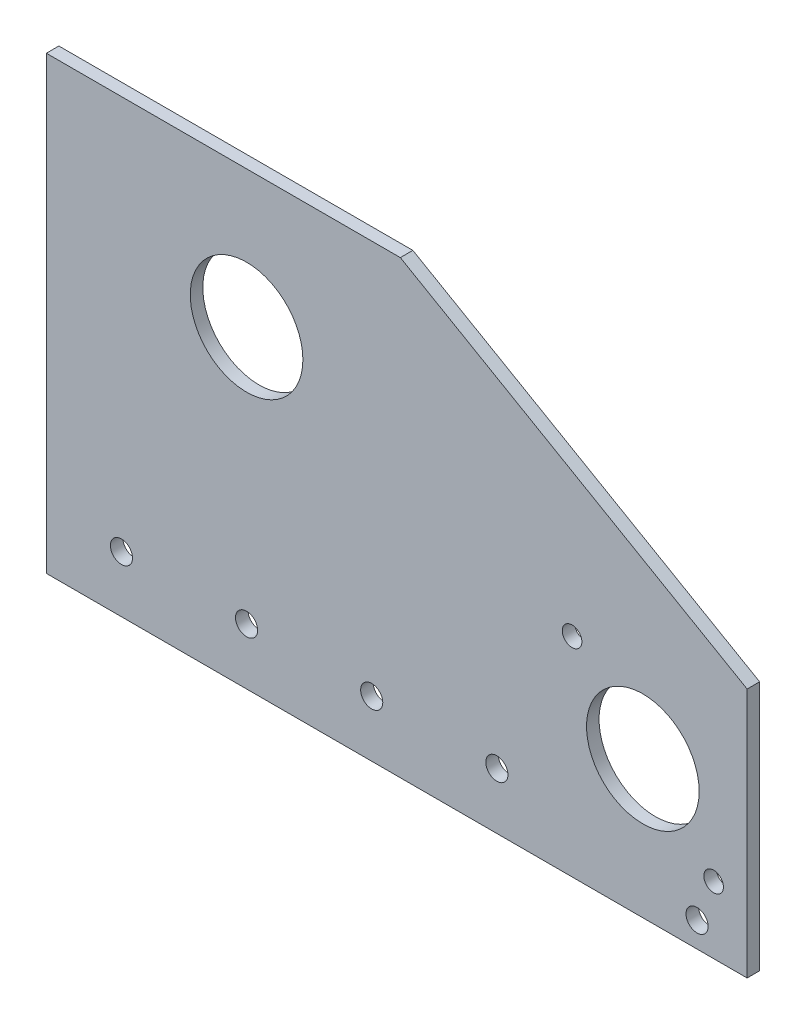
ISO-10303-21;
HEADER;
FILE_DESCRIPTION(('STEP AP214'),'2;1');
FILE_NAME('part.step','',(''),(''),'','','');
FILE_SCHEMA(('AUTOMOTIVE_DESIGN { 1 0 10303 214 1 1 1 1 }'));
ENDSEC;
DATA;
#1=APPLICATION_CONTEXT('core data for automotive mechanical design processes');
#2=APPLICATION_PROTOCOL_DEFINITION('international standard','automotive_design',2000,#1);
#3=PRODUCT_CONTEXT('',#1,'mechanical');
#4=PRODUCT('Part','Part','',(#3));
#5=PRODUCT_RELATED_PRODUCT_CATEGORY('part','',(#4));
#6=PRODUCT_DEFINITION_FORMATION('','',#4);
#7=PRODUCT_DEFINITION_CONTEXT('part definition',#1,'design');
#8=PRODUCT_DEFINITION('design','',#6,#7);
#9=PRODUCT_DEFINITION_SHAPE('','',#8);
#10=(LENGTH_UNIT() NAMED_UNIT(*) SI_UNIT(.MILLI.,.METRE.));
#11=(NAMED_UNIT(*) PLANE_ANGLE_UNIT() SI_UNIT($,.RADIAN.));
#12=(NAMED_UNIT(*) SI_UNIT($,.STERADIAN.) SOLID_ANGLE_UNIT());
#13=UNCERTAINTY_MEASURE_WITH_UNIT(LENGTH_MEASURE(1.E-05),#10,'distance_accuracy_value','');
#14=(GEOMETRIC_REPRESENTATION_CONTEXT(3) GLOBAL_UNCERTAINTY_ASSIGNED_CONTEXT((#13)) GLOBAL_UNIT_ASSIGNED_CONTEXT((#10,
#11,#12)) REPRESENTATION_CONTEXT('',''));
#15=CARTESIAN_POINT('',(0.,0.,0.));
#16=DIRECTION('',(0.,0.,1.));
#17=DIRECTION('',(1.,0.,0.));
#18=AXIS2_PLACEMENT_3D('',#15,#16,#17);
#19=CARTESIAN_POINT('',(88.9,57.15,3.175));
#20=DIRECTION('',(-1.,0.,0.));
#21=DIRECTION('',(0.,-1.,0.));
#22=AXIS2_PLACEMENT_3D('',#19,#20,#21);
#23=PLANE('',#22);
#24=DIRECTION('',(0.,1.,0.));
#25=VECTOR('',#24,1.);
#26=CARTESIAN_POINT('',(88.9,57.15,0.));
#27=LINE('',#26,#25);
#28=CARTESIAN_POINT('',(88.9,-57.15,0.));
#29=VERTEX_POINT('',#28);
#30=CARTESIAN_POINT('',(88.9,6.34999999999987,0.));
#31=VERTEX_POINT('',#30);
#32=EDGE_CURVE('E110',#29,#31,#27,.T.);
#33=ORIENTED_EDGE('',*,*,#32,.T.);
#34=DIRECTION('',(0.,0.,1.));
#35=VECTOR('',#34,1.);
#36=CARTESIAN_POINT('',(88.9,6.34999999999987,3.175));
#37=LINE('',#36,#35);
#38=CARTESIAN_POINT('',(88.9,6.34999999999987,3.175));
#39=VERTEX_POINT('',#38);
#40=EDGE_CURVE('E42',#31,#39,#37,.T.);
#41=ORIENTED_EDGE('',*,*,#40,.T.);
#42=DIRECTION('',(0.,1.,0.));
#43=VECTOR('',#42,1.);
#44=CARTESIAN_POINT('',(88.9,57.15,3.175));
#45=LINE('',#44,#43);
#46=CARTESIAN_POINT('',(88.9,-57.15,3.175));
#47=VERTEX_POINT('',#46);
#48=EDGE_CURVE('E90',#47,#39,#45,.T.);
#49=ORIENTED_EDGE('',*,*,#48,.F.);
#50=DIRECTION('',(0.,0.,-1.));
#51=VECTOR('',#50,1.);
#52=CARTESIAN_POINT('',(88.9,-57.15,3.175));
#53=LINE('',#52,#51);
#54=EDGE_CURVE('E106',#47,#29,#53,.T.);
#55=ORIENTED_EDGE('',*,*,#54,.T.);
#56=EDGE_LOOP('',(#33,#41,#49,#55));
#57=FACE_BOUND('',#56,.T.);
#58=ADVANCED_FACE('F34',(#57),#23,.F.);
#59=CARTESIAN_POINT('',(-88.9,57.15,3.175));
#60=DIRECTION('',(0.,-1.,0.));
#61=DIRECTION('',(0.,0.,-1.));
#62=AXIS2_PLACEMENT_3D('',#59,#60,#61);
#63=PLANE('',#62);
#64=DIRECTION('',(-1.,0.,0.));
#65=VECTOR('',#64,1.);
#66=CARTESIAN_POINT('',(-88.9,57.15,3.175));
#67=LINE('',#66,#65);
#68=CARTESIAN_POINT('',(0.911818975500972,57.15,3.175));
#69=VERTEX_POINT('',#68);
#70=CARTESIAN_POINT('',(-88.9,57.15,3.175));
#71=VERTEX_POINT('',#70);
#72=EDGE_CURVE('E80',#69,#71,#67,.T.);
#73=ORIENTED_EDGE('',*,*,#72,.F.);
#74=DIRECTION('',(0.,0.,-1.));
#75=VECTOR('',#74,1.);
#76=CARTESIAN_POINT('',(0.911818975501036,57.15,3.175));
#77=LINE('',#76,#75);
#78=CARTESIAN_POINT('',(0.911818975500975,57.15,0.));
#79=VERTEX_POINT('',#78);
#80=EDGE_CURVE('E98',#69,#79,#77,.T.);
#81=ORIENTED_EDGE('',*,*,#80,.T.);
#82=DIRECTION('',(-1.,0.,0.));
#83=VECTOR('',#82,1.);
#84=CARTESIAN_POINT('',(-88.9,57.15,0.));
#85=LINE('',#84,#83);
#86=CARTESIAN_POINT('',(-88.9,57.15,0.));
#87=VERTEX_POINT('',#86);
#88=EDGE_CURVE('E95',#79,#87,#85,.T.);
#89=ORIENTED_EDGE('',*,*,#88,.T.);
#90=DIRECTION('',(0.,0.,-1.));
#91=VECTOR('',#90,1.);
#92=CARTESIAN_POINT('',(-88.9,57.15,3.175));
#93=LINE('',#92,#91);
#94=EDGE_CURVE('E93',#71,#87,#93,.T.);
#95=ORIENTED_EDGE('',*,*,#94,.F.);
#96=EDGE_LOOP('',(#73,#81,#89,#95));
#97=FACE_BOUND('',#96,.T.);
#98=ADVANCED_FACE('F94',(#97),#63,.F.);
#99=CARTESIAN_POINT('',(-88.9,57.15,3.175));
#100=DIRECTION('',(1.,0.,0.));
#101=DIRECTION('',(0.,1.,0.));
#102=AXIS2_PLACEMENT_3D('',#99,#100,#101);
#103=PLANE('',#102);
#104=DIRECTION('',(0.,-1.,0.));
#105=VECTOR('',#104,1.);
#106=CARTESIAN_POINT('',(-88.9,57.15,0.));
#107=LINE('',#106,#105);
#108=CARTESIAN_POINT('',(-88.9,-57.15,0.));
#109=VERTEX_POINT('',#108);
#110=EDGE_CURVE('E114',#87,#109,#107,.T.);
#111=ORIENTED_EDGE('',*,*,#110,.T.);
#112=DIRECTION('',(0.,0.,-1.));
#113=VECTOR('',#112,1.);
#114=CARTESIAN_POINT('',(-88.9,-57.15,3.175));
#115=LINE('',#114,#113);
#116=CARTESIAN_POINT('',(-88.9,-57.15,3.175));
#117=VERTEX_POINT('',#116);
#118=EDGE_CURVE('E99',#117,#109,#115,.T.);
#119=ORIENTED_EDGE('',*,*,#118,.F.);
#120=DIRECTION('',(0.,-1.,0.));
#121=VECTOR('',#120,1.);
#122=CARTESIAN_POINT('',(-88.9,57.15,3.175));
#123=LINE('',#122,#121);
#124=EDGE_CURVE('E84',#71,#117,#123,.T.);
#125=ORIENTED_EDGE('',*,*,#124,.F.);
#126=ORIENTED_EDGE('',*,*,#94,.T.);
#127=EDGE_LOOP('',(#111,#119,#125,#126));
#128=FACE_BOUND('',#127,.T.);
#129=ADVANCED_FACE('F101',(#128),#103,.F.);
#130=CARTESIAN_POINT('',(-88.9,-57.15,3.175));
#131=DIRECTION('',(0.,1.,0.));
#132=DIRECTION('',(0.,0.,1.));
#133=AXIS2_PLACEMENT_3D('',#130,#131,#132);
#134=PLANE('',#133);
#135=DIRECTION('',(1.,0.,0.));
#136=VECTOR('',#135,1.);
#137=CARTESIAN_POINT('',(-88.9,-57.15,0.));
#138=LINE('',#137,#136);
#139=EDGE_CURVE('E116',#109,#29,#138,.T.);
#140=ORIENTED_EDGE('',*,*,#139,.T.);
#141=ORIENTED_EDGE('',*,*,#54,.F.);
#142=DIRECTION('',(1.,0.,0.));
#143=VECTOR('',#142,1.);
#144=CARTESIAN_POINT('',(-88.9,-57.15,3.175));
#145=LINE('',#144,#143);
#146=EDGE_CURVE('E104',#117,#47,#145,.T.);
#147=ORIENTED_EDGE('',*,*,#146,.F.);
#148=ORIENTED_EDGE('',*,*,#118,.T.);
#149=EDGE_LOOP('',(#140,#141,#147,#148));
#150=FACE_BOUND('',#149,.T.);
#151=ADVANCED_FACE('F126',(#150),#134,.F.);
#152=CARTESIAN_POINT('',(0.,0.,3.175));
#153=DIRECTION('',(0.,0.,1.));
#154=DIRECTION('',(1.,0.,0.));
#155=AXIS2_PLACEMENT_3D('',#152,#153,#154);
#156=PLANE('',#155);
#157=CARTESIAN_POINT('',(76.2,-50.8,3.175));
#158=DIRECTION('',(0.,0.,-1.));
#159=DIRECTION('',(-1.,0.,0.));
#160=AXIS2_PLACEMENT_3D('',#157,#158,#159);
#161=CIRCLE('',#160,2.8067);
#162=CARTESIAN_POINT('',(73.3933,-50.8,3.175));
#163=VERTEX_POINT('',#162);
#164=EDGE_CURVE('E265',#163,#163,#161,.T.);
#165=ORIENTED_EDGE('',*,*,#164,.T.);
#166=EDGE_LOOP('',(#165));
#167=FACE_BOUND('',#166,.T.);
#168=CARTESIAN_POINT('',(80.4036939851088,-40.1855122421383,3.175));
#169=DIRECTION('',(0.,0.,1.));
#170=DIRECTION('',(1.,0.,0.));
#171=AXIS2_PLACEMENT_3D('',#168,#169,#170);
#172=CIRCLE('',#171,2.4892);
#173=CARTESIAN_POINT('',(82.8928939851088,-40.1855122421383,3.175));
#174=VERTEX_POINT('',#173);
#175=EDGE_CURVE('E197',#174,#174,#172,.T.);
#176=ORIENTED_EDGE('',*,*,#175,.F.);
#177=EDGE_LOOP('',(#176));
#178=FACE_BOUND('',#177,.T.);
#179=CARTESIAN_POINT('',(44.4826695008322,-4.26448775786168,3.175));
#180=DIRECTION('',(0.,0.,1.));
#181=DIRECTION('',(1.,0.,0.));
#182=AXIS2_PLACEMENT_3D('',#179,#180,#181);
#183=CIRCLE('',#182,2.4892);
#184=CARTESIAN_POINT('',(46.9718695008322,-4.26448775786168,3.175));
#185=VERTEX_POINT('',#184);
#186=EDGE_CURVE('E190',#185,#185,#183,.T.);
#187=ORIENTED_EDGE('',*,*,#186,.F.);
#188=EDGE_LOOP('',(#187));
#189=FACE_BOUND('',#188,.T.);
#190=CARTESIAN_POINT('',(62.4431817429705,-22.225,3.175));
#191=DIRECTION('',(0.,0.,1.));
#192=DIRECTION('',(1.,0.,0.));
#193=AXIS2_PLACEMENT_3D('',#190,#191,#192);
#194=CIRCLE('',#193,14.2875);
#195=CARTESIAN_POINT('',(76.7306817429705,-22.225,3.175));
#196=VERTEX_POINT('',#195);
#197=EDGE_CURVE('E194',#196,#196,#194,.T.);
#198=ORIENTED_EDGE('',*,*,#197,.F.);
#199=EDGE_LOOP('',(#198));
#200=FACE_BOUND('',#199,.T.);
#201=CARTESIAN_POINT('',(-69.85,-42.8625,3.175));
#202=DIRECTION('',(0.,0.,1.));
#203=DIRECTION('',(1.,0.,0.));
#204=AXIS2_PLACEMENT_3D('',#201,#202,#203);
#205=CIRCLE('',#204,2.8067);
#206=CARTESIAN_POINT('',(-67.0433,-42.8625,3.175));
#207=VERTEX_POINT('',#206);
#208=EDGE_CURVE('E204',#207,#207,#205,.T.);
#209=ORIENTED_EDGE('',*,*,#208,.F.);
#210=EDGE_LOOP('',(#209));
#211=FACE_BOUND('',#210,.T.);
#212=CARTESIAN_POINT('',(-38.1,-42.8625,3.175));
#213=DIRECTION('',(0.,0.,1.));
#214=DIRECTION('',(1.,0.,0.));
#215=AXIS2_PLACEMENT_3D('',#212,#213,#214);
#216=CIRCLE('',#215,2.8067);
#217=CARTESIAN_POINT('',(-35.2933,-42.8625,3.175));
#218=VERTEX_POINT('',#217);
#219=EDGE_CURVE('E212',#218,#218,#216,.T.);
#220=ORIENTED_EDGE('',*,*,#219,.F.);
#221=EDGE_LOOP('',(#220));
#222=FACE_BOUND('',#221,.T.);
#223=CARTESIAN_POINT('',(-6.35000000000001,-42.8625,3.175));
#224=DIRECTION('',(0.,0.,1.));
#225=DIRECTION('',(1.,0.,0.));
#226=AXIS2_PLACEMENT_3D('',#223,#224,#225);
#227=CIRCLE('',#226,2.8067);
#228=CARTESIAN_POINT('',(-3.54330000000001,-42.8625,3.175));
#229=VERTEX_POINT('',#228);
#230=EDGE_CURVE('E218',#229,#229,#227,.T.);
#231=ORIENTED_EDGE('',*,*,#230,.F.);
#232=EDGE_LOOP('',(#231));
#233=FACE_BOUND('',#232,.T.);
#234=CARTESIAN_POINT('',(25.4,-42.8625,3.175));
#235=DIRECTION('',(0.,0.,1.));
#236=DIRECTION('',(1.,0.,0.));
#237=AXIS2_PLACEMENT_3D('',#234,#235,#236);
#238=CIRCLE('',#237,2.8067);
#239=CARTESIAN_POINT('',(28.2067,-42.8625,3.175));
#240=VERTEX_POINT('',#239);
#241=EDGE_CURVE('E224',#240,#240,#238,.T.);
#242=ORIENTED_EDGE('',*,*,#241,.F.);
#243=EDGE_LOOP('',(#242));
#244=FACE_BOUND('',#243,.T.);
#245=CARTESIAN_POINT('',(-38.1,22.352,3.175));
#246=DIRECTION('',(0.,0.,1.));
#247=DIRECTION('',(1.,0.,0.));
#248=AXIS2_PLACEMENT_3D('',#245,#246,#247);
#249=CIRCLE('',#248,14.2875);
#250=CARTESIAN_POINT('',(-23.8125,22.352,3.175));
#251=VERTEX_POINT('',#250);
#252=EDGE_CURVE('E230',#251,#251,#249,.T.);
#253=ORIENTED_EDGE('',*,*,#252,.F.);
#254=EDGE_LOOP('',(#253));
#255=FACE_BOUND('',#254,.T.);
#256=ORIENTED_EDGE('',*,*,#48,.T.);
#257=DIRECTION('',(0.866025403784438,-0.500000000000001,0.));
#258=VECTOR('',#257,1.);
#259=CARTESIAN_POINT('',(24.9746306570156,43.2573291982182,3.175));
#260=LINE('',#259,#258);
#261=EDGE_CURVE('E11',#39,#69,#260,.F.);
#262=ORIENTED_EDGE('',*,*,#261,.T.);
#263=ORIENTED_EDGE('',*,*,#72,.T.);
#264=ORIENTED_EDGE('',*,*,#124,.T.);
#265=ORIENTED_EDGE('',*,*,#146,.T.);
#266=EDGE_LOOP('',(#256,#262,#263,#264,#265));
#267=FACE_BOUND('',#266,.T.);
#268=ADVANCED_FACE('F82',(#167,#178,#189,#200,#211,#222,#233,#244,#255,#267),#156,.T.);
#269=CARTESIAN_POINT('',(0.,0.,0.));
#270=DIRECTION('',(0.,0.,1.));
#271=DIRECTION('',(1.,0.,0.));
#272=AXIS2_PLACEMENT_3D('',#269,#270,#271);
#273=PLANE('',#272);
#274=CARTESIAN_POINT('',(76.2,-50.8,0.));
#275=DIRECTION('',(0.,0.,-1.));
#276=DIRECTION('',(-1.,0.,0.));
#277=AXIS2_PLACEMENT_3D('',#274,#275,#276);
#278=CIRCLE('',#277,2.8067);
#279=CARTESIAN_POINT('',(73.3933,-50.8,0.));
#280=VERTEX_POINT('',#279);
#281=EDGE_CURVE('E269',#280,#280,#278,.T.);
#282=ORIENTED_EDGE('',*,*,#281,.F.);
#283=EDGE_LOOP('',(#282));
#284=FACE_BOUND('',#283,.T.);
#285=CARTESIAN_POINT('',(80.4036939851088,-40.1855122421383,0.));
#286=DIRECTION('',(0.,0.,1.));
#287=DIRECTION('',(1.,0.,0.));
#288=AXIS2_PLACEMENT_3D('',#285,#286,#287);
#289=CIRCLE('',#288,2.4892);
#290=CARTESIAN_POINT('',(82.8928939851088,-40.1855122421383,0.));
#291=VERTEX_POINT('',#290);
#292=EDGE_CURVE('E192',#291,#291,#289,.T.);
#293=ORIENTED_EDGE('',*,*,#292,.T.);
#294=EDGE_LOOP('',(#293));
#295=FACE_BOUND('',#294,.T.);
#296=CARTESIAN_POINT('',(44.4826695008322,-4.26448775786168,0.));
#297=DIRECTION('',(0.,0.,1.));
#298=DIRECTION('',(1.,0.,0.));
#299=AXIS2_PLACEMENT_3D('',#296,#297,#298);
#300=CIRCLE('',#299,2.4892);
#301=CARTESIAN_POINT('',(46.9718695008322,-4.26448775786168,0.));
#302=VERTEX_POINT('',#301);
#303=EDGE_CURVE('E187',#302,#302,#300,.T.);
#304=ORIENTED_EDGE('',*,*,#303,.T.);
#305=EDGE_LOOP('',(#304));
#306=FACE_BOUND('',#305,.T.);
#307=CARTESIAN_POINT('',(62.4431817429705,-22.225,0.));
#308=DIRECTION('',(0.,0.,1.));
#309=DIRECTION('',(1.,0.,0.));
#310=AXIS2_PLACEMENT_3D('',#307,#308,#309);
#311=CIRCLE('',#310,14.2875);
#312=CARTESIAN_POINT('',(76.7306817429705,-22.225,0.));
#313=VERTEX_POINT('',#312);
#314=EDGE_CURVE('E201',#313,#313,#311,.T.);
#315=ORIENTED_EDGE('',*,*,#314,.T.);
#316=EDGE_LOOP('',(#315));
#317=FACE_BOUND('',#316,.T.);
#318=CARTESIAN_POINT('',(-69.85,-42.8625,0.));
#319=DIRECTION('',(0.,0.,1.));
#320=DIRECTION('',(1.,0.,0.));
#321=AXIS2_PLACEMENT_3D('',#318,#319,#320);
#322=CIRCLE('',#321,2.8067);
#323=CARTESIAN_POINT('',(-67.0433,-42.8625,0.));
#324=VERTEX_POINT('',#323);
#325=EDGE_CURVE('E209',#324,#324,#322,.T.);
#326=ORIENTED_EDGE('',*,*,#325,.T.);
#327=EDGE_LOOP('',(#326));
#328=FACE_BOUND('',#327,.T.);
#329=CARTESIAN_POINT('',(-38.1,-42.8625,0.));
#330=DIRECTION('',(0.,0.,1.));
#331=DIRECTION('',(1.,0.,0.));
#332=AXIS2_PLACEMENT_3D('',#329,#330,#331);
#333=CIRCLE('',#332,2.8067);
#334=CARTESIAN_POINT('',(-35.2933,-42.8625,0.));
#335=VERTEX_POINT('',#334);
#336=EDGE_CURVE('E215',#335,#335,#333,.T.);
#337=ORIENTED_EDGE('',*,*,#336,.T.);
#338=EDGE_LOOP('',(#337));
#339=FACE_BOUND('',#338,.T.);
#340=CARTESIAN_POINT('',(-6.35000000000001,-42.8625,0.));
#341=DIRECTION('',(0.,0.,1.));
#342=DIRECTION('',(1.,0.,0.));
#343=AXIS2_PLACEMENT_3D('',#340,#341,#342);
#344=CIRCLE('',#343,2.8067);
#345=CARTESIAN_POINT('',(-3.54330000000001,-42.8625,0.));
#346=VERTEX_POINT('',#345);
#347=EDGE_CURVE('E221',#346,#346,#344,.T.);
#348=ORIENTED_EDGE('',*,*,#347,.T.);
#349=EDGE_LOOP('',(#348));
#350=FACE_BOUND('',#349,.T.);
#351=CARTESIAN_POINT('',(25.4,-42.8625,0.));
#352=DIRECTION('',(0.,0.,1.));
#353=DIRECTION('',(1.,0.,0.));
#354=AXIS2_PLACEMENT_3D('',#351,#352,#353);
#355=CIRCLE('',#354,2.8067);
#356=CARTESIAN_POINT('',(28.2067,-42.8625,0.));
#357=VERTEX_POINT('',#356);
#358=EDGE_CURVE('E227',#357,#357,#355,.T.);
#359=ORIENTED_EDGE('',*,*,#358,.T.);
#360=EDGE_LOOP('',(#359));
#361=FACE_BOUND('',#360,.T.);
#362=CARTESIAN_POINT('',(-38.1,22.352,0.));
#363=DIRECTION('',(0.,0.,1.));
#364=DIRECTION('',(1.,0.,0.));
#365=AXIS2_PLACEMENT_3D('',#362,#363,#364);
#366=CIRCLE('',#365,14.2875);
#367=CARTESIAN_POINT('',(-23.8125,22.352,0.));
#368=VERTEX_POINT('',#367);
#369=EDGE_CURVE('E112',#368,#368,#366,.T.);
#370=ORIENTED_EDGE('',*,*,#369,.T.);
#371=EDGE_LOOP('',(#370));
#372=FACE_BOUND('',#371,.T.);
#373=ORIENTED_EDGE('',*,*,#88,.F.);
#374=DIRECTION('',(-0.866025403784438,0.500000000000001,0.));
#375=VECTOR('',#374,1.);
#376=CARTESIAN_POINT('',(0.911818975501036,57.15,0.));
#377=LINE('',#376,#375);
#378=EDGE_CURVE('E56',#79,#31,#377,.F.);
#379=ORIENTED_EDGE('',*,*,#378,.T.);
#380=ORIENTED_EDGE('',*,*,#32,.F.);
#381=ORIENTED_EDGE('',*,*,#139,.F.);
#382=ORIENTED_EDGE('',*,*,#110,.F.);
#383=EDGE_LOOP('',(#373,#379,#380,#381,#382));
#384=FACE_BOUND('',#383,.T.);
#385=ADVANCED_FACE('F123',(#284,#295,#306,#317,#328,#339,#350,#361,#372,#384),#273,.F.);
#386=CARTESIAN_POINT('',(-38.1,22.352,0.));
#387=DIRECTION('',(0.,0.,1.));
#388=DIRECTION('',(1.,0.,0.));
#389=AXIS2_PLACEMENT_3D('',#386,#387,#388);
#390=CYLINDRICAL_SURFACE('',#389,14.2875);
#391=ORIENTED_EDGE('',*,*,#369,.F.);
#392=EDGE_LOOP('',(#391));
#393=FACE_BOUND('',#392,.T.);
#394=ORIENTED_EDGE('',*,*,#252,.T.);
#395=EDGE_LOOP('',(#394));
#396=FACE_BOUND('',#395,.T.);
#397=ADVANCED_FACE('F152',(#393,#396),#390,.F.);
#398=CARTESIAN_POINT('',(25.4,-42.8625,3.175));
#399=DIRECTION('',(0.,0.,1.));
#400=DIRECTION('',(1.,0.,0.));
#401=AXIS2_PLACEMENT_3D('',#398,#399,#400);
#402=CYLINDRICAL_SURFACE('',#401,2.8067);
#403=ORIENTED_EDGE('',*,*,#358,.F.);
#404=EDGE_LOOP('',(#403));
#405=FACE_BOUND('',#404,.T.);
#406=ORIENTED_EDGE('',*,*,#241,.T.);
#407=EDGE_LOOP('',(#406));
#408=FACE_BOUND('',#407,.T.);
#409=ADVANCED_FACE('F159',(#405,#408),#402,.F.);
#410=CARTESIAN_POINT('',(-6.35000000000001,-42.8625,3.175));
#411=DIRECTION('',(0.,0.,1.));
#412=DIRECTION('',(1.,0.,0.));
#413=AXIS2_PLACEMENT_3D('',#410,#411,#412);
#414=CYLINDRICAL_SURFACE('',#413,2.8067);
#415=ORIENTED_EDGE('',*,*,#347,.F.);
#416=EDGE_LOOP('',(#415));
#417=FACE_BOUND('',#416,.T.);
#418=ORIENTED_EDGE('',*,*,#230,.T.);
#419=EDGE_LOOP('',(#418));
#420=FACE_BOUND('',#419,.T.);
#421=ADVANCED_FACE('F163',(#417,#420),#414,.F.);
#422=CARTESIAN_POINT('',(-38.1,-42.8625,3.175));
#423=DIRECTION('',(0.,0.,1.));
#424=DIRECTION('',(1.,0.,0.));
#425=AXIS2_PLACEMENT_3D('',#422,#423,#424);
#426=CYLINDRICAL_SURFACE('',#425,2.8067);
#427=ORIENTED_EDGE('',*,*,#336,.F.);
#428=EDGE_LOOP('',(#427));
#429=FACE_BOUND('',#428,.T.);
#430=ORIENTED_EDGE('',*,*,#219,.T.);
#431=EDGE_LOOP('',(#430));
#432=FACE_BOUND('',#431,.T.);
#433=ADVANCED_FACE('F167',(#429,#432),#426,.F.);
#434=CARTESIAN_POINT('',(-69.85,-42.8625,3.175));
#435=DIRECTION('',(0.,0.,1.));
#436=DIRECTION('',(1.,0.,0.));
#437=AXIS2_PLACEMENT_3D('',#434,#435,#436);
#438=CYLINDRICAL_SURFACE('',#437,2.8067);
#439=ORIENTED_EDGE('',*,*,#325,.F.);
#440=EDGE_LOOP('',(#439));
#441=FACE_BOUND('',#440,.T.);
#442=ORIENTED_EDGE('',*,*,#208,.T.);
#443=EDGE_LOOP('',(#442));
#444=FACE_BOUND('',#443,.T.);
#445=ADVANCED_FACE('F171',(#441,#444),#438,.F.);
#446=CARTESIAN_POINT('',(62.4431817429705,-22.225,0.));
#447=DIRECTION('',(0.,0.,1.));
#448=DIRECTION('',(1.,0.,0.));
#449=AXIS2_PLACEMENT_3D('',#446,#447,#448);
#450=CYLINDRICAL_SURFACE('',#449,14.2875);
#451=ORIENTED_EDGE('',*,*,#314,.F.);
#452=EDGE_LOOP('',(#451));
#453=FACE_BOUND('',#452,.T.);
#454=ORIENTED_EDGE('',*,*,#197,.T.);
#455=EDGE_LOOP('',(#454));
#456=FACE_BOUND('',#455,.T.);
#457=ADVANCED_FACE('F175',(#453,#456),#450,.F.);
#458=CARTESIAN_POINT('',(44.4826695008322,-4.26448775786168,0.));
#459=DIRECTION('',(0.,0.,1.));
#460=DIRECTION('',(1.,0.,0.));
#461=AXIS2_PLACEMENT_3D('',#458,#459,#460);
#462=CYLINDRICAL_SURFACE('',#461,2.4892);
#463=ORIENTED_EDGE('',*,*,#303,.F.);
#464=EDGE_LOOP('',(#463));
#465=FACE_BOUND('',#464,.T.);
#466=ORIENTED_EDGE('',*,*,#186,.T.);
#467=EDGE_LOOP('',(#466));
#468=FACE_BOUND('',#467,.T.);
#469=ADVANCED_FACE('F137',(#465,#468),#462,.F.);
#470=CARTESIAN_POINT('',(80.4036939851088,-40.1855122421383,0.));
#471=DIRECTION('',(0.,0.,1.));
#472=DIRECTION('',(1.,0.,0.));
#473=AXIS2_PLACEMENT_3D('',#470,#471,#472);
#474=CYLINDRICAL_SURFACE('',#473,2.4892);
#475=ORIENTED_EDGE('',*,*,#292,.F.);
#476=EDGE_LOOP('',(#475));
#477=FACE_BOUND('',#476,.T.);
#478=ORIENTED_EDGE('',*,*,#175,.T.);
#479=EDGE_LOOP('',(#478));
#480=FACE_BOUND('',#479,.T.);
#481=ADVANCED_FACE('F130',(#477,#480),#474,.F.);
#482=CARTESIAN_POINT('',(0.911818975501036,57.15,3.175));
#483=DIRECTION('',(-0.500000000000001,-0.866025403784438,0.));
#484=DIRECTION('',(0.,0.,-1.));
#485=AXIS2_PLACEMENT_3D('',#482,#483,#484);
#486=PLANE('',#485);
#487=ORIENTED_EDGE('',*,*,#261,.F.);
#488=ORIENTED_EDGE('',*,*,#40,.F.);
#489=ORIENTED_EDGE('',*,*,#378,.F.);
#490=ORIENTED_EDGE('',*,*,#80,.F.);
#491=EDGE_LOOP('',(#487,#488,#489,#490));
#492=FACE_BOUND('',#491,.T.);
#493=ADVANCED_FACE('F36',(#492),#486,.F.);
#494=CARTESIAN_POINT('',(76.2,-50.8,0.));
#495=DIRECTION('',(0.,0.,-1.));
#496=DIRECTION('',(-1.,0.,0.));
#497=AXIS2_PLACEMENT_3D('',#494,#495,#496);
#498=CYLINDRICAL_SURFACE('',#497,2.8067);
#499=ORIENTED_EDGE('',*,*,#164,.F.);
#500=EDGE_LOOP('',(#499));
#501=FACE_BOUND('',#500,.T.);
#502=ORIENTED_EDGE('',*,*,#281,.T.);
#503=EDGE_LOOP('',(#502));
#504=FACE_BOUND('',#503,.T.);
#505=ADVANCED_FACE('F129',(#501,#504),#498,.F.);
#506=CLOSED_SHELL('',(#58,#98,#129,#151,#268,#385,#397,#409,#421,#433,#445,#457,#469,#481,#493,#505));
#507=MANIFOLD_SOLID_BREP('B2',#506);
#508=ADVANCED_BREP_SHAPE_REPRESENTATION('',(#18,#507),#14);
#509=SHAPE_DEFINITION_REPRESENTATION(#9,#508);
ENDSEC;
END-ISO-10303-21;
